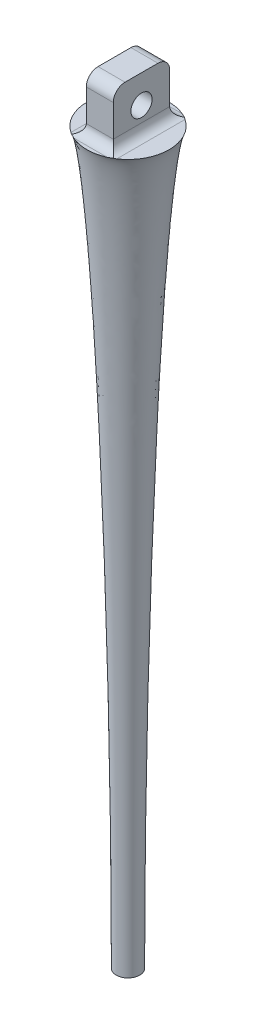
ISO-10303-21;
HEADER;
FILE_DESCRIPTION(('STEP AP214'),'2;1');
FILE_NAME('part.step','',(''),(''),'','','');
FILE_SCHEMA(('AUTOMOTIVE_DESIGN { 1 0 10303 214 1 1 1 1 }'));
ENDSEC;
DATA;
#1=APPLICATION_CONTEXT('core data for automotive mechanical design processes');
#2=APPLICATION_PROTOCOL_DEFINITION('international standard','automotive_design',2000,#1);
#3=PRODUCT_CONTEXT('',#1,'mechanical');
#4=PRODUCT('Part','Part','',(#3));
#5=PRODUCT_RELATED_PRODUCT_CATEGORY('part','',(#4));
#6=PRODUCT_DEFINITION_FORMATION('','',#4);
#7=PRODUCT_DEFINITION_CONTEXT('part definition',#1,'design');
#8=PRODUCT_DEFINITION('design','',#6,#7);
#9=PRODUCT_DEFINITION_SHAPE('','',#8);
#10=(LENGTH_UNIT() NAMED_UNIT(*) SI_UNIT(.MILLI.,.METRE.));
#11=(NAMED_UNIT(*) PLANE_ANGLE_UNIT() SI_UNIT($,.RADIAN.));
#12=(NAMED_UNIT(*) SI_UNIT($,.STERADIAN.) SOLID_ANGLE_UNIT());
#13=UNCERTAINTY_MEASURE_WITH_UNIT(LENGTH_MEASURE(1.E-05),#10,'distance_accuracy_value','');
#14=(GEOMETRIC_REPRESENTATION_CONTEXT(3) GLOBAL_UNCERTAINTY_ASSIGNED_CONTEXT((#13)) GLOBAL_UNIT_ASSIGNED_CONTEXT((#10,
#11,#12)) REPRESENTATION_CONTEXT('',''));
#15=CARTESIAN_POINT('',(0.,0.,0.));
#16=DIRECTION('',(0.,0.,1.));
#17=DIRECTION('',(1.,0.,0.));
#18=AXIS2_PLACEMENT_3D('',#15,#16,#17);
#19=CARTESIAN_POINT('',(0.,0.,0.));
#20=DIRECTION('',(0.,-1.,0.));
#21=DIRECTION('',(1.,0.,0.));
#22=AXIS2_PLACEMENT_3D('',#19,#20,#21);
#23=PLANE('',#22);
#24=CARTESIAN_POINT('',(0.,0.,0.));
#25=DIRECTION('',(0.,1.,0.));
#26=DIRECTION('',(-1.,0.,0.));
#27=AXIS2_PLACEMENT_3D('',#24,#25,#26);
#28=CIRCLE('',#27,3.5);
#29=CARTESIAN_POINT('',(-1.95,0.,-2.90645832586672));
#30=VERTEX_POINT('',#29);
#31=CARTESIAN_POINT('',(-1.95,0.,2.90645832586672));
#32=VERTEX_POINT('',#31);
#33=EDGE_CURVE('E167',#30,#32,#28,.T.);
#34=ORIENTED_EDGE('',*,*,#33,.T.);
#35=DIRECTION('',(0.,0.,1.));
#36=VECTOR('',#35,1.);
#37=CARTESIAN_POINT('',(-1.95,0.,-2.4));
#38=LINE('',#37,#36);
#39=EDGE_CURVE('E173',#32,#30,#38,.F.);
#40=ORIENTED_EDGE('',*,*,#39,.T.);
#41=EDGE_LOOP('',(#34,#40));
#42=FACE_BOUND('',#41,.T.);
#43=ADVANCED_FACE('F32',(#42),#23,.F.);
#44=CARTESIAN_POINT('',(1.41774468787578,0.,-3.2));
#45=VERTEX_POINT('',#44);
#46=CARTESIAN_POINT('',(-1.41774468787578,0.,-3.2));
#47=VERTEX_POINT('',#46);
#48=EDGE_CURVE('E264',#45,#47,#28,.T.);
#49=ORIENTED_EDGE('',*,*,#48,.T.);
#50=DIRECTION('',(-1.,0.,0.));
#51=VECTOR('',#50,1.);
#52=CARTESIAN_POINT('',(1.15,0.,-3.2));
#53=LINE('',#52,#51);
#54=EDGE_CURVE('E171',#47,#45,#53,.F.);
#55=ORIENTED_EDGE('',*,*,#54,.T.);
#56=EDGE_LOOP('',(#49,#55));
#57=FACE_BOUND('',#56,.T.);
#58=ADVANCED_FACE('F243',(#57),#23,.F.);
#59=CARTESIAN_POINT('',(-1.41774468787578,0.,3.2));
#60=VERTEX_POINT('',#59);
#61=CARTESIAN_POINT('',(1.41774468787578,0.,3.2));
#62=VERTEX_POINT('',#61);
#63=EDGE_CURVE('E160',#60,#62,#28,.T.);
#64=ORIENTED_EDGE('',*,*,#63,.T.);
#65=DIRECTION('',(1.,0.,0.));
#66=VECTOR('',#65,1.);
#67=CARTESIAN_POINT('',(-1.15,0.,3.2));
#68=LINE('',#67,#66);
#69=EDGE_CURVE('E162',#62,#60,#68,.F.);
#70=ORIENTED_EDGE('',*,*,#69,.T.);
#71=EDGE_LOOP('',(#64,#70));
#72=FACE_BOUND('',#71,.T.);
#73=ADVANCED_FACE('F248',(#72),#23,.F.);
#74=CARTESIAN_POINT('',(1.95,0.,2.90645832586672));
#75=VERTEX_POINT('',#74);
#76=CARTESIAN_POINT('',(1.95,0.,-2.90645832586672));
#77=VERTEX_POINT('',#76);
#78=EDGE_CURVE('E165',#75,#77,#28,.T.);
#79=ORIENTED_EDGE('',*,*,#78,.T.);
#80=DIRECTION('',(0.,0.,-1.));
#81=VECTOR('',#80,1.);
#82=CARTESIAN_POINT('',(1.95,0.,2.4));
#83=LINE('',#82,#81);
#84=EDGE_CURVE('E159',#77,#75,#83,.F.);
#85=ORIENTED_EDGE('',*,*,#84,.T.);
#86=EDGE_LOOP('',(#79,#85));
#87=FACE_BOUND('',#86,.T.);
#88=ADVANCED_FACE('F199',(#87),#23,.F.);
#89=CARTESIAN_POINT('',(1.00000000000001,-62.1103956237084,0.));
#90=CARTESIAN_POINT('',(1.,-35.4734220252964,0.));
#91=CARTESIAN_POINT('',(2.18653421701543,-2.52553796459548,0.));
#92=CARTESIAN_POINT('',(3.5,0.,0.));
#93=CARTESIAN_POINT('',(3.51313465782985,0.0252553796459548,0.));
#94=CARTESIAN_POINT('',(3.52626931565969,0.0505107592919096,0.));
#95=CARTESIAN_POINT('',(3.53940397348954,0.0757661389378643,0.));
#96=B_SPLINE_CURVE_WITH_KNOTS('',3,(#89,#90,#91,#92,#93,#94,#95),.UNSPECIFIED.,.F.,.F.,(4,3,4),
(0.,1.,1.01),.UNSPECIFIED.);
#97=CARTESIAN_POINT('',(0.,0.,0.));
#98=DIRECTION('',(0.,1.,0.));
#99=AXIS1_PLACEMENT('',#97,#98);
#100=SURFACE_OF_REVOLUTION('',#96,#99);
#101=ORIENTED_EDGE('',*,*,#63,.F.);
#102=CARTESIAN_POINT('',(-1.41774468787578,0.,3.2));
#103=CARTESIAN_POINT('',(-1.43804222254705,-3.94687179672858E-08,3.19100735660219));
#104=CARTESIAN_POINT('',(-1.45828628533577,0.000151630970977015,3.18189346900746));
#105=CARTESIAN_POINT('',(-1.49865012133321,0.00078233544021157,3.16344557331929));
#106=CARTESIAN_POINT('',(-1.51876997722664,0.00126112087444102,3.15411173757548));
#107=CARTESIAN_POINT('',(-1.55889077175201,0.00256966151873371,3.13523642657953));
#108=CARTESIAN_POINT('',(-1.57889175513437,0.00339927488719858,3.12569503671984));
#109=CARTESIAN_POINT('',(-1.61878110432213,0.0054333486768971,3.10641696434359));
#110=CARTESIAN_POINT('',(-1.63866946644596,0.00663782128103579,3.09668027548944));
#111=CARTESIAN_POINT('',(-1.67833737442683,0.00944587178265342,3.07702537496586));
#112=CARTESIAN_POINT('',(-1.69811687710415,0.0110495978125877,3.06710709719089));
#113=CARTESIAN_POINT('',(-1.73757190159674,0.0146809805103024,3.04710314087347));
#114=CARTESIAN_POINT('',(-1.75724732752526,0.0167089754303428,3.03701733470986));
#115=CARTESIAN_POINT('',(-1.77686102609484,0.0189603750672637,3.02686102609484));
#116=B_SPLINE_CURVE_WITH_KNOTS('',3,(#102,#103,#104,#105,#106,#107,#108,#109,#110,#111,#112,
#113,#114,#115),.UNSPECIFIED.,.F.,.F.,(4,2,2,2,2,2,4),(0.,0.0666006063665261,0.133150654949928,
0.199673822680888,0.26619915263704,0.332749201943982,0.399352512475468),.UNSPECIFIED.);
#117=CARTESIAN_POINT('',(-1.77686102609486,0.0189603750672664,3.02686102609485));
#118=VERTEX_POINT('',#117);
#119=EDGE_CURVE('E215',#60,#118,#116,.T.);
#120=ORIENTED_EDGE('',*,*,#119,.T.);
#121=CARTESIAN_POINT('',(-1.77686102609486,0.0189603750672664,3.02686102609485));
#122=CARTESIAN_POINT('',(-1.80515302163258,0.0126737483174652,3.00647451339946));
#123=CARTESIAN_POINT('',(-1.83372726722687,0.00795040368695882,2.98624769869943));
#124=CARTESIAN_POINT('',(-1.89144025852858,0.0016302786645359,2.94611346529005));
#125=CARTESIAN_POINT('',(-1.92057900423601,3.34982726192997E-05,2.92620604658071));
#126=CARTESIAN_POINT('',(-1.95,0.,2.90645832586672));
#127=B_SPLINE_CURVE_WITH_KNOTS('',3,(#121,#122,#123,#124,#125,#126),.UNSPECIFIED.,.F.,.F.,(4,2,
4),(0.,0.105977798421264,0.211955596842529),.UNSPECIFIED.);
#128=EDGE_CURVE('E143',#118,#32,#127,.T.);
#129=ORIENTED_EDGE('',*,*,#128,.T.);
#130=ORIENTED_EDGE('',*,*,#33,.F.);
#131=CARTESIAN_POINT('',(-1.95,0.,-2.90645832586672));
#132=CARTESIAN_POINT('',(-1.92057900423601,3.34982726200164E-05,-2.92620604658072));
#133=CARTESIAN_POINT('',(-1.89144025852858,0.00163027866453676,-2.94611346529006));
#134=CARTESIAN_POINT('',(-1.83372726722686,0.00795040368695881,-2.98624769869943));
#135=CARTESIAN_POINT('',(-1.80515302163257,0.0126737483174641,-3.00647451339946));
#136=CARTESIAN_POINT('',(-1.77686102609484,0.0189603750672637,-3.02686102609484));
#137=B_SPLINE_CURVE_WITH_KNOTS('',3,(#131,#132,#133,#134,#135,#136),.UNSPECIFIED.,.F.,.F.,(4,2,
4),(0.,0.105977798421269,0.211955596842537),.UNSPECIFIED.);
#138=CARTESIAN_POINT('',(-1.77686102609484,0.0189603750672637,-3.02686102609484));
#139=VERTEX_POINT('',#138);
#140=EDGE_CURVE('E185',#30,#139,#137,.T.);
#141=ORIENTED_EDGE('',*,*,#140,.T.);
#142=CARTESIAN_POINT('',(-1.77686102609486,0.0189603750672664,-3.02686102609485));
#143=CARTESIAN_POINT('',(-1.75724732752527,0.0167089754303443,-3.03701733470987));
#144=CARTESIAN_POINT('',(-1.73757190159675,0.0146809805103034,-3.04710314087347));
#145=CARTESIAN_POINT('',(-1.69811687710416,0.0110495978125882,-3.06710709719088));
#146=CARTESIAN_POINT('',(-1.67833737442684,0.00944587178265401,-3.07702537496586));
#147=CARTESIAN_POINT('',(-1.63866946644596,0.00663782128103621,-3.09668027548943));
#148=CARTESIAN_POINT('',(-1.61878110432214,0.00543334867689732,-3.10641696434358));
#149=CARTESIAN_POINT('',(-1.57889175513437,0.00339927488719865,-3.12569503671984));
#150=CARTESIAN_POINT('',(-1.55889077175201,0.00256966151873383,-3.13523642657953));
#151=CARTESIAN_POINT('',(-1.51876997722664,0.00126112087444118,-3.15411173757547));
#152=CARTESIAN_POINT('',(-1.49865012133321,0.000782335440211716,-3.16344557331929));
#153=CARTESIAN_POINT('',(-1.45828628533577,0.000151630970977099,-3.18189346900746));
#154=CARTESIAN_POINT('',(-1.43804222254705,-3.9468717928559E-08,-3.19100735660219));
#155=CARTESIAN_POINT('',(-1.41774468787578,0.,-3.2));
#156=B_SPLINE_CURVE_WITH_KNOTS('',3,(#142,#143,#144,#145,#146,#147,#148,#149,#150,#151,#152,
#153,#154,#155),.UNSPECIFIED.,.F.,.F.,(4,2,2,2,2,2,4),(0.,0.0666033105314883,0.133153359838432,
0.199678689794586,0.266201857525548,0.332751906108952,0.39935251247548),.UNSPECIFIED.);
#157=EDGE_CURVE('E318',#139,#47,#156,.T.);
#158=ORIENTED_EDGE('',*,*,#157,.T.);
#159=ORIENTED_EDGE('',*,*,#48,.F.);
#160=CARTESIAN_POINT('',(1.41774468787578,0.,-3.2));
#161=CARTESIAN_POINT('',(1.43804222254705,-3.94687167502414E-08,-3.19100735660219));
#162=CARTESIAN_POINT('',(1.45828628533577,0.000151630970978268,-3.18189346900746));
#163=CARTESIAN_POINT('',(1.49865012133321,0.000782335440212922,-3.16344557331929));
#164=CARTESIAN_POINT('',(1.51876997722664,0.00126112087444243,-3.15411173757548));
#165=CARTESIAN_POINT('',(1.55889077175201,0.00256966151873513,-3.13523642657953));
#166=CARTESIAN_POINT('',(1.57889175513437,0.00339927488719996,-3.12569503671984));
#167=CARTESIAN_POINT('',(1.61878110432213,0.00543334867689854,-3.10641696434359));
#168=CARTESIAN_POINT('',(1.63866946644596,0.00663782128103734,-3.09668027548944));
#169=CARTESIAN_POINT('',(1.67833737442683,0.00944587178265501,-3.07702537496586));
#170=CARTESIAN_POINT('',(1.69811687710415,0.0110495978125892,-3.06710709719089));
#171=CARTESIAN_POINT('',(1.73757190159674,0.0146809805103038,-3.04710314087347));
#172=CARTESIAN_POINT('',(1.75724732752526,0.0167089754303442,-3.03701733470986));
#173=CARTESIAN_POINT('',(1.77686102609484,0.0189603750672653,-3.02686102609484));
#174=B_SPLINE_CURVE_WITH_KNOTS('',3,(#160,#161,#162,#163,#164,#165,#166,#167,#168,#169,#170,
#171,#172,#173),.UNSPECIFIED.,.F.,.F.,(4,2,2,2,2,2,4),(0.,0.0666006063665261,0.133150654949928,
0.199673822680888,0.26619915263704,0.332749201943982,0.399352512475468),.UNSPECIFIED.);
#175=CARTESIAN_POINT('',(1.77686102609484,0.0189603750672653,-3.02686102609484));
#176=VERTEX_POINT('',#175);
#177=EDGE_CURVE('E319',#45,#176,#174,.T.);
#178=ORIENTED_EDGE('',*,*,#177,.T.);
#179=CARTESIAN_POINT('',(1.77686102609486,0.018960375067268,-3.02686102609485));
#180=CARTESIAN_POINT('',(1.80515302163258,0.0126737483174668,-3.00647451339946));
#181=CARTESIAN_POINT('',(1.83372726722687,0.00795040368696043,-2.98624769869943));
#182=CARTESIAN_POINT('',(1.89144025852858,0.00163027866453754,-2.94611346529005));
#183=CARTESIAN_POINT('',(1.92057900423601,3.34982726209766E-05,-2.92620604658071));
#184=CARTESIAN_POINT('',(1.95,0.,-2.90645832586672));
#185=B_SPLINE_CURVE_WITH_KNOTS('',3,(#179,#180,#181,#182,#183,#184),.UNSPECIFIED.,.F.,.F.,(4,2,
4),(0.,0.105977798421265,0.21195559684253),.UNSPECIFIED.);
#186=EDGE_CURVE('E220',#176,#77,#185,.T.);
#187=ORIENTED_EDGE('',*,*,#186,.T.);
#188=ORIENTED_EDGE('',*,*,#78,.F.);
#189=CARTESIAN_POINT('',(1.95,0.,2.90645832586672));
#190=CARTESIAN_POINT('',(1.92057900423601,3.34982726217475E-05,2.92620604658072));
#191=CARTESIAN_POINT('',(1.89144025852858,0.00163027866453848,2.94611346529006));
#192=CARTESIAN_POINT('',(1.83372726722686,0.00795040368696051,2.98624769869943));
#193=CARTESIAN_POINT('',(1.80515302163256,0.0126737483174658,3.00647451339946));
#194=CARTESIAN_POINT('',(1.77686102609484,0.0189603750672653,3.02686102609484));
#195=B_SPLINE_CURVE_WITH_KNOTS('',3,(#189,#190,#191,#192,#193,#194),.UNSPECIFIED.,.F.,.F.,(4,2,
4),(0.,0.10597779842127,0.211955596842538),.UNSPECIFIED.);
#196=CARTESIAN_POINT('',(1.77686102609486,0.018960375067268,3.02686102609485));
#197=VERTEX_POINT('',#196);
#198=EDGE_CURVE('E225',#75,#197,#195,.T.);
#199=ORIENTED_EDGE('',*,*,#198,.T.);
#200=CARTESIAN_POINT('',(1.77686102609486,0.018960375067268,3.02686102609485));
#201=CARTESIAN_POINT('',(1.75724732752527,0.0167089754303459,3.03701733470987));
#202=CARTESIAN_POINT('',(1.73757190159675,0.014680980510305,3.04710314087347));
#203=CARTESIAN_POINT('',(1.69811687710416,0.0110495978125898,3.06710709719088));
#204=CARTESIAN_POINT('',(1.67833737442684,0.00944587178265555,3.07702537496586));
#205=CARTESIAN_POINT('',(1.63866946644596,0.00663782128103769,3.09668027548943));
#206=CARTESIAN_POINT('',(1.61878110432214,0.00543334867689875,3.10641696434358));
#207=CARTESIAN_POINT('',(1.57889175513437,0.00339927488720011,3.12569503671984));
#208=CARTESIAN_POINT('',(1.55889077175201,0.00256966151873537,3.13523642657953));
#209=CARTESIAN_POINT('',(1.51876997722664,0.00126112087444269,3.15411173757547));
#210=CARTESIAN_POINT('',(1.49865012133321,0.000782335440213103,3.16344557331929));
#211=CARTESIAN_POINT('',(1.45828628533577,0.000151630970978308,3.18189346900746));
#212=CARTESIAN_POINT('',(1.43804222254705,-3.94687167768285E-08,3.19100735660219));
#213=CARTESIAN_POINT('',(1.41774468787578,0.,3.2));
#214=B_SPLINE_CURVE_WITH_KNOTS('',3,(#200,#201,#202,#203,#204,#205,#206,#207,#208,#209,#210,
#211,#212,#213),.UNSPECIFIED.,.F.,.F.,(4,2,2,2,2,2,4),(0.,0.0666033105314885,0.133153359838433,
0.199678689794586,0.266201857525549,0.332751906108953,0.399352512475481),.UNSPECIFIED.);
#215=EDGE_CURVE('E209',#197,#62,#214,.T.);
#216=ORIENTED_EDGE('',*,*,#215,.T.);
#217=EDGE_LOOP('',(#101,#120,#129,#130,#141,#158,#159,#178,#187,#188,#199,#216));
#218=FACE_BOUND('',#217,.T.);
#219=CARTESIAN_POINT('',(0.,-62.1103956237084,0.));
#220=DIRECTION('',(0.,1.,0.));
#221=DIRECTION('',(-1.,0.,0.));
#222=AXIS2_PLACEMENT_3D('',#219,#220,#221);
#223=CIRCLE('',#222,0.99999999999998);
#224=CARTESIAN_POINT('',(-0.999999999999952,-62.1103956237084,0.));
#225=VERTEX_POINT('',#224);
#226=EDGE_CURVE('E299',#225,#225,#223,.T.);
#227=ORIENTED_EDGE('',*,*,#226,.T.);
#228=EDGE_LOOP('',(#227));
#229=FACE_BOUND('',#228,.T.);
#230=ADVANCED_FACE('F190',(#218,#229),#100,.T.);
#231=CARTESIAN_POINT('',(0.,-62.1103956237084,0.));
#232=DIRECTION('',(0.,1.,0.));
#233=DIRECTION('',(-1.,0.,0.));
#234=AXIS2_PLACEMENT_3D('',#231,#232,#233);
#235=PLANE('',#234);
#236=ORIENTED_EDGE('',*,*,#226,.F.);
#237=EDGE_LOOP('',(#236));
#238=FACE_BOUND('',#237,.T.);
#239=ADVANCED_FACE('F257',(#238),#235,.F.);
#240=CARTESIAN_POINT('',(1.15,4.5,2.4));
#241=DIRECTION('',(-1.,0.,0.));
#242=DIRECTION('',(0.,0.,1.));
#243=AXIS2_PLACEMENT_3D('',#240,#241,#242);
#244=PLANE('',#243);
#245=CARTESIAN_POINT('',(1.15,2.1,0.));
#246=DIRECTION('',(-1.,0.,0.));
#247=DIRECTION('',(0.,0.,1.));
#248=AXIS2_PLACEMENT_3D('',#245,#246,#247);
#249=CIRCLE('',#248,0.9);
#250=CARTESIAN_POINT('',(1.15,2.1,0.9));
#251=VERTEX_POINT('',#250);
#252=EDGE_CURVE('E293',#251,#251,#249,.F.);
#253=ORIENTED_EDGE('',*,*,#252,.F.);
#254=EDGE_LOOP('',(#253));
#255=FACE_BOUND('',#254,.T.);
#256=DIRECTION('',(0.,-1.,0.));
#257=VECTOR('',#256,1.);
#258=CARTESIAN_POINT('',(1.15,4.5,-2.4));
#259=LINE('',#258,#257);
#260=CARTESIAN_POINT('',(1.15,3.5,-2.4));
#261=VERTEX_POINT('',#260);
#262=CARTESIAN_POINT('',(1.15,0.8,-2.4));
#263=VERTEX_POINT('',#262);
#264=EDGE_CURVE('E289',#261,#263,#259,.T.);
#265=ORIENTED_EDGE('',*,*,#264,.F.);
#266=CARTESIAN_POINT('',(1.15,3.5,-1.4));
#267=DIRECTION('',(-1.,0.,0.));
#268=DIRECTION('',(0.,0.,1.));
#269=AXIS2_PLACEMENT_3D('',#266,#267,#268);
#270=CIRCLE('',#269,1.);
#271=CARTESIAN_POINT('',(1.15,4.5,-1.4));
#272=VERTEX_POINT('',#271);
#273=EDGE_CURVE('E40',#261,#272,#270,.F.);
#274=ORIENTED_EDGE('',*,*,#273,.T.);
#275=DIRECTION('',(0.,0.,-1.));
#276=VECTOR('',#275,1.);
#277=CARTESIAN_POINT('',(1.15,4.5,2.4));
#278=LINE('',#277,#276);
#279=CARTESIAN_POINT('',(1.15,4.5,1.4));
#280=VERTEX_POINT('',#279);
#281=EDGE_CURVE('E288',#280,#272,#278,.T.);
#282=ORIENTED_EDGE('',*,*,#281,.F.);
#283=CARTESIAN_POINT('',(1.15,3.5,1.4));
#284=DIRECTION('',(-1.,0.,0.));
#285=DIRECTION('',(0.,0.,1.));
#286=AXIS2_PLACEMENT_3D('',#283,#284,#285);
#287=CIRCLE('',#286,1.);
#288=CARTESIAN_POINT('',(1.15,3.5,2.4));
#289=VERTEX_POINT('',#288);
#290=EDGE_CURVE('E47',#280,#289,#287,.F.);
#291=ORIENTED_EDGE('',*,*,#290,.T.);
#292=DIRECTION('',(0.,-1.,0.));
#293=VECTOR('',#292,1.);
#294=CARTESIAN_POINT('',(1.15,4.5,2.4));
#295=LINE('',#294,#293);
#296=CARTESIAN_POINT('',(1.15,0.8,2.4));
#297=VERTEX_POINT('',#296);
#298=EDGE_CURVE('E132',#289,#297,#295,.T.);
#299=ORIENTED_EDGE('',*,*,#298,.T.);
#300=DIRECTION('',(0.,0.,-1.));
#301=VECTOR('',#300,1.);
#302=CARTESIAN_POINT('',(1.15,0.8,-2.4));
#303=LINE('',#302,#301);
#304=EDGE_CURVE('E153',#297,#263,#303,.T.);
#305=ORIENTED_EDGE('',*,*,#304,.T.);
#306=EDGE_LOOP('',(#265,#274,#282,#291,#299,#305));
#307=FACE_BOUND('',#306,.T.);
#308=ADVANCED_FACE('F287',(#255,#307),#244,.F.);
#309=CARTESIAN_POINT('',(-1.15,4.5,-2.4));
#310=DIRECTION('',(0.,0.,1.));
#311=DIRECTION('',(1.,0.,0.));
#312=AXIS2_PLACEMENT_3D('',#309,#310,#311);
#313=PLANE('',#312);
#314=DIRECTION('',(0.,-1.,0.));
#315=VECTOR('',#314,1.);
#316=CARTESIAN_POINT('',(-1.15,4.5,-2.4));
#317=LINE('',#316,#315);
#318=CARTESIAN_POINT('',(-1.15,3.5,-2.4));
#319=VERTEX_POINT('',#318);
#320=CARTESIAN_POINT('',(-1.15,0.799999999999999,-2.4));
#321=VERTEX_POINT('',#320);
#322=EDGE_CURVE('E131',#319,#321,#317,.T.);
#323=ORIENTED_EDGE('',*,*,#322,.F.);
#324=DIRECTION('',(-1.,0.,0.));
#325=VECTOR('',#324,1.);
#326=CARTESIAN_POINT('',(-1.15,3.5,-2.4));
#327=LINE('',#326,#325);
#328=EDGE_CURVE('E55',#319,#261,#327,.F.);
#329=ORIENTED_EDGE('',*,*,#328,.T.);
#330=ORIENTED_EDGE('',*,*,#264,.T.);
#331=DIRECTION('',(-1.,0.,0.));
#332=VECTOR('',#331,1.);
#333=CARTESIAN_POINT('',(-1.15,0.799999999999999,-2.4));
#334=LINE('',#333,#332);
#335=EDGE_CURVE('E154',#263,#321,#334,.T.);
#336=ORIENTED_EDGE('',*,*,#335,.T.);
#337=EDGE_LOOP('',(#323,#329,#330,#336));
#338=FACE_BOUND('',#337,.T.);
#339=ADVANCED_FACE('F295',(#338),#313,.F.);
#340=CARTESIAN_POINT('',(-1.15,4.5,2.4));
#341=DIRECTION('',(1.,0.,0.));
#342=DIRECTION('',(0.,0.,-1.));
#343=AXIS2_PLACEMENT_3D('',#340,#341,#342);
#344=PLANE('',#343);
#345=CARTESIAN_POINT('',(-1.15,2.1,0.));
#346=DIRECTION('',(-1.,0.,0.));
#347=DIRECTION('',(0.,0.,1.));
#348=AXIS2_PLACEMENT_3D('',#345,#346,#347);
#349=CIRCLE('',#348,0.9);
#350=CARTESIAN_POINT('',(-1.15,2.1,0.9));
#351=VERTEX_POINT('',#350);
#352=EDGE_CURVE('E328',#351,#351,#349,.T.);
#353=ORIENTED_EDGE('',*,*,#352,.F.);
#354=EDGE_LOOP('',(#353));
#355=FACE_BOUND('',#354,.T.);
#356=DIRECTION('',(0.,0.,1.));
#357=VECTOR('',#356,1.);
#358=CARTESIAN_POINT('',(-1.15,4.5,2.4));
#359=LINE('',#358,#357);
#360=CARTESIAN_POINT('',(-1.15,4.5,-1.4));
#361=VERTEX_POINT('',#360);
#362=CARTESIAN_POINT('',(-1.15,4.5,1.4));
#363=VERTEX_POINT('',#362);
#364=EDGE_CURVE('E292',#361,#363,#359,.T.);
#365=ORIENTED_EDGE('',*,*,#364,.F.);
#366=CARTESIAN_POINT('',(-1.15,3.5,-1.4));
#367=DIRECTION('',(1.,0.,0.));
#368=DIRECTION('',(0.,0.,-1.));
#369=AXIS2_PLACEMENT_3D('',#366,#367,#368);
#370=CIRCLE('',#369,1.);
#371=EDGE_CURVE('E284',#361,#319,#370,.F.);
#372=ORIENTED_EDGE('',*,*,#371,.T.);
#373=ORIENTED_EDGE('',*,*,#322,.T.);
#374=DIRECTION('',(0.,0.,1.));
#375=VECTOR('',#374,1.);
#376=CARTESIAN_POINT('',(-1.15,0.799999999999999,2.4));
#377=LINE('',#376,#375);
#378=CARTESIAN_POINT('',(-1.15,0.799999999999999,2.4));
#379=VERTEX_POINT('',#378);
#380=EDGE_CURVE('E141',#321,#379,#377,.T.);
#381=ORIENTED_EDGE('',*,*,#380,.T.);
#382=DIRECTION('',(0.,-1.,0.));
#383=VECTOR('',#382,1.);
#384=CARTESIAN_POINT('',(-1.15,4.5,2.4));
#385=LINE('',#384,#383);
#386=CARTESIAN_POINT('',(-1.15,3.5,2.4));
#387=VERTEX_POINT('',#386);
#388=EDGE_CURVE('E121',#387,#379,#385,.T.);
#389=ORIENTED_EDGE('',*,*,#388,.F.);
#390=CARTESIAN_POINT('',(-1.15,3.5,1.4));
#391=DIRECTION('',(1.,0.,0.));
#392=DIRECTION('',(0.,0.,-1.));
#393=AXIS2_PLACEMENT_3D('',#390,#391,#392);
#394=CIRCLE('',#393,1.);
#395=EDGE_CURVE('E277',#387,#363,#394,.F.);
#396=ORIENTED_EDGE('',*,*,#395,.T.);
#397=EDGE_LOOP('',(#365,#372,#373,#381,#389,#396));
#398=FACE_BOUND('',#397,.T.);
#399=ADVANCED_FACE('F157',(#355,#398),#344,.F.);
#400=CARTESIAN_POINT('',(-1.15,4.5,2.4));
#401=DIRECTION('',(0.,0.,-1.));
#402=DIRECTION('',(-1.,0.,0.));
#403=AXIS2_PLACEMENT_3D('',#400,#401,#402);
#404=PLANE('',#403);
#405=ORIENTED_EDGE('',*,*,#298,.F.);
#406=DIRECTION('',(1.,0.,0.));
#407=VECTOR('',#406,1.);
#408=CARTESIAN_POINT('',(-1.15,3.5,2.4));
#409=LINE('',#408,#407);
#410=EDGE_CURVE('E11',#289,#387,#409,.F.);
#411=ORIENTED_EDGE('',*,*,#410,.T.);
#412=ORIENTED_EDGE('',*,*,#388,.T.);
#413=DIRECTION('',(1.,0.,0.));
#414=VECTOR('',#413,1.);
#415=CARTESIAN_POINT('',(1.15,0.8,2.4));
#416=LINE('',#415,#414);
#417=EDGE_CURVE('E125',#379,#297,#416,.T.);
#418=ORIENTED_EDGE('',*,*,#417,.T.);
#419=EDGE_LOOP('',(#405,#411,#412,#418));
#420=FACE_BOUND('',#419,.T.);
#421=ADVANCED_FACE('F123',(#420),#404,.F.);
#422=CARTESIAN_POINT('',(0.,4.5,0.));
#423=DIRECTION('',(0.,-1.,0.));
#424=DIRECTION('',(0.,0.,-1.));
#425=AXIS2_PLACEMENT_3D('',#422,#423,#424);
#426=PLANE('',#425);
#427=ORIENTED_EDGE('',*,*,#281,.T.);
#428=DIRECTION('',(-1.,0.,0.));
#429=VECTOR('',#428,1.);
#430=CARTESIAN_POINT('',(0.,4.5,-1.4));
#431=LINE('',#430,#429);
#432=EDGE_CURVE('E270',#272,#361,#431,.T.);
#433=ORIENTED_EDGE('',*,*,#432,.T.);
#434=ORIENTED_EDGE('',*,*,#364,.T.);
#435=DIRECTION('',(1.,0.,0.));
#436=VECTOR('',#435,1.);
#437=CARTESIAN_POINT('',(0.,4.5,1.4));
#438=LINE('',#437,#436);
#439=EDGE_CURVE('E268',#363,#280,#438,.T.);
#440=ORIENTED_EDGE('',*,*,#439,.T.);
#441=EDGE_LOOP('',(#427,#433,#434,#440));
#442=FACE_BOUND('',#441,.T.);
#443=ADVANCED_FACE('F291',(#442),#426,.F.);
#444=CARTESIAN_POINT('',(3.501,2.1,0.));
#445=DIRECTION('',(-1.,0.,0.));
#446=DIRECTION('',(0.,0.,1.));
#447=AXIS2_PLACEMENT_3D('',#444,#445,#446);
#448=CYLINDRICAL_SURFACE('',#447,0.9);
#449=ORIENTED_EDGE('',*,*,#352,.T.);
#450=EDGE_LOOP('',(#449));
#451=FACE_BOUND('',#450,.T.);
#452=ORIENTED_EDGE('',*,*,#252,.T.);
#453=EDGE_LOOP('',(#452));
#454=FACE_BOUND('',#453,.T.);
#455=ADVANCED_FACE('F232',(#451,#454),#448,.F.);
#456=CARTESIAN_POINT('',(1.95,0.8,2.4));
#457=DIRECTION('',(0.,0.,1.));
#458=DIRECTION('',(1.,0.,0.));
#459=AXIS2_PLACEMENT_3D('',#456,#457,#458);
#460=CYLINDRICAL_SURFACE('',#459,0.8);
#461=ORIENTED_EDGE('',*,*,#84,.F.);
#462=ORIENTED_EDGE('',*,*,#186,.F.);
#463=CARTESIAN_POINT('',(1.95,0.8,-3.2));
#464=DIRECTION('',(0.707106781186547,0.,0.707106781186547));
#465=DIRECTION('',(0.707106781186547,0.,-0.707106781186547));
#466=AXIS2_PLACEMENT_3D('',#463,#464,#465);
#467=ELLIPSE('',#466,1.13137084989848,0.8);
#468=EDGE_CURVE('E280',#263,#176,#467,.T.);
#469=ORIENTED_EDGE('',*,*,#468,.F.);
#470=ORIENTED_EDGE('',*,*,#304,.F.);
#471=CARTESIAN_POINT('',(1.95,0.8,3.2));
#472=DIRECTION('',(-0.707106781186547,0.,0.707106781186547));
#473=DIRECTION('',(-0.707106781186547,0.,-0.707106781186547));
#474=AXIS2_PLACEMENT_3D('',#471,#472,#473);
#475=ELLIPSE('',#474,1.13137084989848,0.8);
#476=EDGE_CURVE('E152',#197,#297,#475,.F.);
#477=ORIENTED_EDGE('',*,*,#476,.F.);
#478=ORIENTED_EDGE('',*,*,#198,.F.);
#479=EDGE_LOOP('',(#461,#462,#469,#470,#477,#478));
#480=FACE_BOUND('',#479,.T.);
#481=ADVANCED_FACE('F229',(#480),#460,.F.);
#482=CARTESIAN_POINT('',(-1.15,0.799999999999999,-3.2));
#483=DIRECTION('',(1.,0.,0.));
#484=DIRECTION('',(0.,1.,0.));
#485=AXIS2_PLACEMENT_3D('',#482,#483,#484);
#486=CYLINDRICAL_SURFACE('',#485,0.8);
#487=ORIENTED_EDGE('',*,*,#54,.F.);
#488=ORIENTED_EDGE('',*,*,#157,.F.);
#489=CARTESIAN_POINT('',(-1.95,0.799999999999999,-3.2));
#490=DIRECTION('',(0.707106781186547,0.,-0.707106781186547));
#491=DIRECTION('',(-0.707106781186547,0.,-0.707106781186547));
#492=AXIS2_PLACEMENT_3D('',#489,#490,#491);
#493=ELLIPSE('',#492,1.13137084989848,0.8);
#494=EDGE_CURVE('E146',#321,#139,#493,.T.);
#495=ORIENTED_EDGE('',*,*,#494,.F.);
#496=ORIENTED_EDGE('',*,*,#335,.F.);
#497=ORIENTED_EDGE('',*,*,#468,.T.);
#498=ORIENTED_EDGE('',*,*,#177,.F.);
#499=EDGE_LOOP('',(#487,#488,#495,#496,#497,#498));
#500=FACE_BOUND('',#499,.T.);
#501=ADVANCED_FACE('F204',(#500),#486,.F.);
#502=CARTESIAN_POINT('',(-1.15,0.799999999999999,3.2));
#503=DIRECTION('',(-1.,0.,0.));
#504=DIRECTION('',(0.,-1.,0.));
#505=AXIS2_PLACEMENT_3D('',#502,#503,#504);
#506=CYLINDRICAL_SURFACE('',#505,0.8);
#507=ORIENTED_EDGE('',*,*,#476,.T.);
#508=ORIENTED_EDGE('',*,*,#417,.F.);
#509=CARTESIAN_POINT('',(-1.95,0.799999999999999,3.2));
#510=DIRECTION('',(-0.707106781186547,0.,-0.707106781186547));
#511=DIRECTION('',(0.707106781186547,0.,-0.707106781186547));
#512=AXIS2_PLACEMENT_3D('',#509,#510,#511);
#513=ELLIPSE('',#512,1.13137084989848,0.8);
#514=EDGE_CURVE('E138',#118,#379,#513,.F.);
#515=ORIENTED_EDGE('',*,*,#514,.F.);
#516=ORIENTED_EDGE('',*,*,#119,.F.);
#517=ORIENTED_EDGE('',*,*,#69,.F.);
#518=ORIENTED_EDGE('',*,*,#215,.F.);
#519=EDGE_LOOP('',(#507,#508,#515,#516,#517,#518));
#520=FACE_BOUND('',#519,.T.);
#521=ADVANCED_FACE('F149',(#520),#506,.F.);
#522=CARTESIAN_POINT('',(-1.95,0.799999999999999,2.4));
#523=DIRECTION('',(0.,0.,-1.));
#524=DIRECTION('',(-1.,0.,0.));
#525=AXIS2_PLACEMENT_3D('',#522,#523,#524);
#526=CYLINDRICAL_SURFACE('',#525,0.8);
#527=ORIENTED_EDGE('',*,*,#140,.F.);
#528=ORIENTED_EDGE('',*,*,#39,.F.);
#529=ORIENTED_EDGE('',*,*,#128,.F.);
#530=ORIENTED_EDGE('',*,*,#514,.T.);
#531=ORIENTED_EDGE('',*,*,#380,.F.);
#532=ORIENTED_EDGE('',*,*,#494,.T.);
#533=EDGE_LOOP('',(#527,#528,#529,#530,#531,#532));
#534=FACE_BOUND('',#533,.T.);
#535=ADVANCED_FACE('F139',(#534),#526,.F.);
#536=CARTESIAN_POINT('',(0.,3.5,-1.4));
#537=DIRECTION('',(-1.,0.,0.));
#538=DIRECTION('',(0.,0.,1.));
#539=AXIS2_PLACEMENT_3D('',#536,#537,#538);
#540=CYLINDRICAL_SURFACE('',#539,1.);
#541=ORIENTED_EDGE('',*,*,#273,.F.);
#542=ORIENTED_EDGE('',*,*,#328,.F.);
#543=ORIENTED_EDGE('',*,*,#371,.F.);
#544=ORIENTED_EDGE('',*,*,#432,.F.);
#545=EDGE_LOOP('',(#541,#542,#543,#544));
#546=FACE_BOUND('',#545,.T.);
#547=ADVANCED_FACE('F198',(#546),#540,.T.);
#548=CARTESIAN_POINT('',(0.,3.5,1.4));
#549=DIRECTION('',(1.,0.,0.));
#550=DIRECTION('',(0.,0.,-1.));
#551=AXIS2_PLACEMENT_3D('',#548,#549,#550);
#552=CYLINDRICAL_SURFACE('',#551,1.);
#553=ORIENTED_EDGE('',*,*,#395,.F.);
#554=ORIENTED_EDGE('',*,*,#410,.F.);
#555=ORIENTED_EDGE('',*,*,#290,.F.);
#556=ORIENTED_EDGE('',*,*,#439,.F.);
#557=EDGE_LOOP('',(#553,#554,#555,#556));
#558=FACE_BOUND('',#557,.T.);
#559=ADVANCED_FACE('F34',(#558),#552,.T.);
#560=CLOSED_SHELL('',(#43,#58,#73,#88,#230,#239,#308,#339,#399,#421,#443,#455,#481,#501,#521,
#535,#547,#559));
#561=MANIFOLD_SOLID_BREP('B2',#560);
#562=ADVANCED_BREP_SHAPE_REPRESENTATION('',(#18,#561),#14);
#563=SHAPE_DEFINITION_REPRESENTATION(#9,#562);
ENDSEC;
END-ISO-10303-21;
